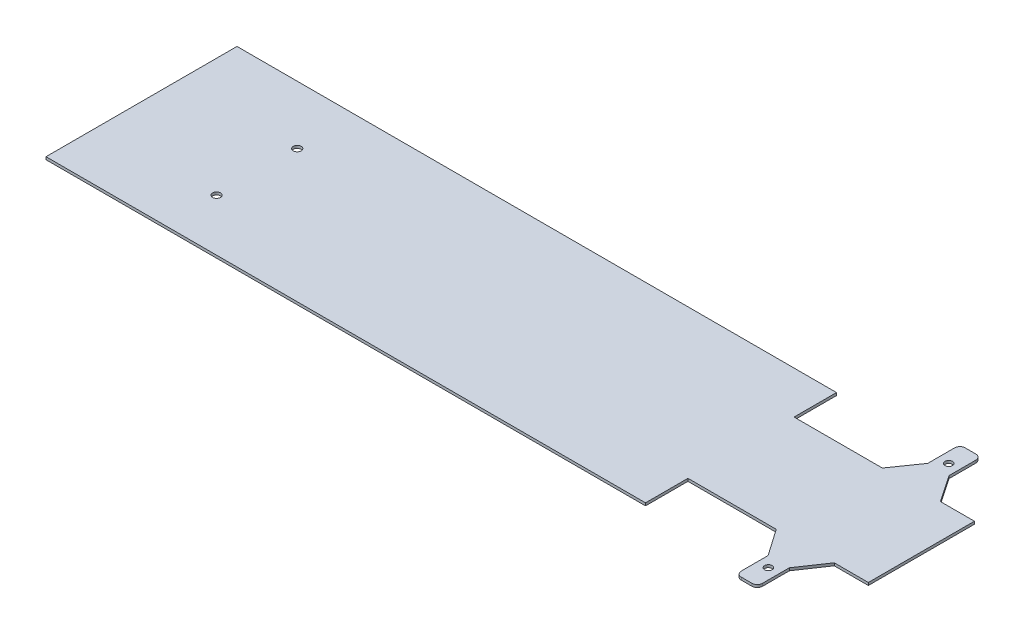
ISO-10303-21;
HEADER;
FILE_DESCRIPTION(('STEP AP214'),'2;1');
FILE_NAME('part.step','',(''),(''),'','','');
FILE_SCHEMA(('AUTOMOTIVE_DESIGN { 1 0 10303 214 1 1 1 1 }'));
ENDSEC;
DATA;
#1=APPLICATION_CONTEXT('core data for automotive mechanical design processes');
#2=APPLICATION_PROTOCOL_DEFINITION('international standard','automotive_design',2000,#1);
#3=PRODUCT_CONTEXT('',#1,'mechanical');
#4=PRODUCT('Part','Part','',(#3));
#5=PRODUCT_RELATED_PRODUCT_CATEGORY('part','',(#4));
#6=PRODUCT_DEFINITION_FORMATION('','',#4);
#7=PRODUCT_DEFINITION_CONTEXT('part definition',#1,'design');
#8=PRODUCT_DEFINITION('design','',#6,#7);
#9=PRODUCT_DEFINITION_SHAPE('','',#8);
#10=(LENGTH_UNIT() NAMED_UNIT(*) SI_UNIT(.MILLI.,.METRE.));
#11=(NAMED_UNIT(*) PLANE_ANGLE_UNIT() SI_UNIT($,.RADIAN.));
#12=(NAMED_UNIT(*) SI_UNIT($,.STERADIAN.) SOLID_ANGLE_UNIT());
#13=UNCERTAINTY_MEASURE_WITH_UNIT(LENGTH_MEASURE(1.E-05),#10,'distance_accuracy_value','');
#14=(GEOMETRIC_REPRESENTATION_CONTEXT(3) GLOBAL_UNCERTAINTY_ASSIGNED_CONTEXT((#13)) GLOBAL_UNIT_ASSIGNED_CONTEXT((#10,
#11,#12)) REPRESENTATION_CONTEXT('',''));
#15=CARTESIAN_POINT('',(0.,0.,0.));
#16=DIRECTION('',(0.,0.,1.));
#17=DIRECTION('',(1.,0.,0.));
#18=AXIS2_PLACEMENT_3D('',#15,#16,#17);
#19=CARTESIAN_POINT('',(-479.708642175763,5.,-523.631578947368));
#20=DIRECTION('',(0.,-1.,0.));
#21=DIRECTION('',(0.,0.,-1.));
#22=AXIS2_PLACEMENT_3D('',#19,#20,#21);
#23=PLANE('',#22);
#24=CARTESIAN_POINT('',(-1597.77020639475,5.,-392.549644623472));
#25=DIRECTION('',(0.,1.,0.));
#26=DIRECTION('',(0.,0.,1.));
#27=AXIS2_PLACEMENT_3D('',#24,#25,#26);
#28=CIRCLE('',#27,7.49999999999996);
#29=CARTESIAN_POINT('',(-1597.77020639475,5.,-385.049644623472));
#30=VERTEX_POINT('',#29);
#31=EDGE_CURVE('E395',#30,#30,#28,.T.);
#32=ORIENTED_EDGE('',*,*,#31,.F.);
#33=EDGE_LOOP('',(#32));
#34=FACE_BOUND('',#33,.T.);
#35=CARTESIAN_POINT('',(-1597.77020639475,5.,-240.607702450479));
#36=DIRECTION('',(0.,1.,0.));
#37=DIRECTION('',(0.,0.,1.));
#38=AXIS2_PLACEMENT_3D('',#35,#36,#37);
#39=CIRCLE('',#38,7.49999999999996);
#40=CARTESIAN_POINT('',(-1597.77020639475,5.,-233.107702450479));
#41=VERTEX_POINT('',#40);
#42=EDGE_CURVE('E403',#41,#41,#39,.T.);
#43=ORIENTED_EDGE('',*,*,#42,.F.);
#44=EDGE_LOOP('',(#43));
#45=FACE_BOUND('',#44,.T.);
#46=DIRECTION('',(0.,0.,-1.));
#47=VECTOR('',#46,1.);
#48=CARTESIAN_POINT('',(-691.29647542446,5.,-502.631578947368));
#49=LINE('',#48,#47);
#50=CARTESIAN_POINT('',(-691.29647542446,5.,-422.631578947368));
#51=VERTEX_POINT('',#50);
#52=CARTESIAN_POINT('',(-691.29647542446,5.,-502.631578947368));
#53=VERTEX_POINT('',#52);
#54=EDGE_CURVE('E311',#51,#53,#49,.T.);
#55=ORIENTED_EDGE('',*,*,#54,.T.);
#56=DIRECTION('',(-1.,0.,0.));
#57=VECTOR('',#56,1.);
#58=CARTESIAN_POINT('',(-691.29647542446,5.,-502.631578947368));
#59=LINE('',#58,#57);
#60=CARTESIAN_POINT('',(-1821.29647542446,5.,-502.631578947368));
#61=VERTEX_POINT('',#60);
#62=EDGE_CURVE('E151',#53,#61,#59,.T.);
#63=ORIENTED_EDGE('',*,*,#62,.T.);
#64=DIRECTION('',(0.,0.,1.));
#65=VECTOR('',#64,1.);
#66=CARTESIAN_POINT('',(-1821.29647542446,5.,-502.631578947368));
#67=LINE('',#66,#65);
#68=CARTESIAN_POINT('',(-1821.29647542446,5.,-142.631578947368));
#69=VERTEX_POINT('',#68);
#70=EDGE_CURVE('E429',#61,#69,#67,.T.);
#71=ORIENTED_EDGE('',*,*,#70,.T.);
#72=DIRECTION('',(1.,0.,0.));
#73=VECTOR('',#72,1.);
#74=CARTESIAN_POINT('',(-691.29647542446,5.,-142.631578947368));
#75=LINE('',#74,#73);
#76=CARTESIAN_POINT('',(-691.29647542446,5.,-142.631578947368));
#77=VERTEX_POINT('',#76);
#78=EDGE_CURVE('E432',#69,#77,#75,.T.);
#79=ORIENTED_EDGE('',*,*,#78,.T.);
#80=DIRECTION('',(0.,0.,-1.));
#81=VECTOR('',#80,1.);
#82=CARTESIAN_POINT('',(-691.29647542446,5.,-222.631578947368));
#83=LINE('',#82,#81);
#84=CARTESIAN_POINT('',(-691.29647542446,5.,-222.631578947368));
#85=VERTEX_POINT('',#84);
#86=EDGE_CURVE('E435',#77,#85,#83,.T.);
#87=ORIENTED_EDGE('',*,*,#86,.T.);
#88=DIRECTION('',(1.,0.,0.));
#89=VECTOR('',#88,1.);
#90=CARTESIAN_POINT('',(-691.29647542446,5.,-222.631578947368));
#91=LINE('',#90,#89);
#92=CARTESIAN_POINT('',(-524.868977384382,5.,-222.631578947368));
#93=VERTEX_POINT('',#92);
#94=EDGE_CURVE('E438',#85,#93,#91,.T.);
#95=ORIENTED_EDGE('',*,*,#94,.T.);
#96=DIRECTION('',(0.571391892362466,0.,0.820677345454619));
#97=VECTOR('',#96,1.);
#98=CARTESIAN_POINT('',(-489.708642175763,5.,-172.131578947368));
#99=LINE('',#98,#97);
#100=CARTESIAN_POINT('',(-489.708642175763,5.,-172.131578947368));
#101=VERTEX_POINT('',#100);
#102=EDGE_CURVE('E441',#93,#101,#99,.T.);
#103=ORIENTED_EDGE('',*,*,#102,.T.);
#104=DIRECTION('',(0.,0.,1.));
#105=VECTOR('',#104,1.);
#106=CARTESIAN_POINT('',(-489.708642175763,5.,-172.131578947368));
#107=LINE('',#106,#105);
#108=CARTESIAN_POINT('',(-489.708642175763,5.,-121.631578947368));
#109=VERTEX_POINT('',#108);
#110=EDGE_CURVE('E444',#101,#109,#107,.T.);
#111=ORIENTED_EDGE('',*,*,#110,.T.);
#112=CARTESIAN_POINT('',(-479.708642175763,5.,-121.631578947368));
#113=DIRECTION('',(0.,1.,0.));
#114=DIRECTION('',(0.,0.,1.));
#115=AXIS2_PLACEMENT_3D('',#112,#113,#114);
#116=CIRCLE('',#115,10.);
#117=CARTESIAN_POINT('',(-479.708642175763,5.,-111.631578947368));
#118=VERTEX_POINT('',#117);
#119=EDGE_CURVE('E447',#109,#118,#116,.T.);
#120=ORIENTED_EDGE('',*,*,#119,.T.);
#121=DIRECTION('',(1.,0.,0.));
#122=VECTOR('',#121,1.);
#123=CARTESIAN_POINT('',(-479.708642175763,5.,-111.631578947368));
#124=LINE('',#123,#122);
#125=CARTESIAN_POINT('',(-459.708642175763,5.,-111.631578947369));
#126=VERTEX_POINT('',#125);
#127=EDGE_CURVE('E450',#118,#126,#124,.T.);
#128=ORIENTED_EDGE('',*,*,#127,.T.);
#129=CARTESIAN_POINT('',(-459.708642175763,5.,-121.631578947369));
#130=DIRECTION('',(0.,1.,0.));
#131=DIRECTION('',(0.,0.,1.));
#132=AXIS2_PLACEMENT_3D('',#129,#130,#131);
#133=CIRCLE('',#132,10.);
#134=CARTESIAN_POINT('',(-449.708642175763,5.,-121.631578947369));
#135=VERTEX_POINT('',#134);
#136=EDGE_CURVE('E453',#126,#135,#133,.T.);
#137=ORIENTED_EDGE('',*,*,#136,.T.);
#138=DIRECTION('',(0.,0.,-1.));
#139=VECTOR('',#138,1.);
#140=CARTESIAN_POINT('',(-449.708642175763,5.,-172.131578947369));
#141=LINE('',#140,#139);
#142=CARTESIAN_POINT('',(-449.708642175763,5.,-172.131578947369));
#143=VERTEX_POINT('',#142);
#144=EDGE_CURVE('E456',#135,#143,#141,.T.);
#145=ORIENTED_EDGE('',*,*,#144,.T.);
#146=DIRECTION('',(0.560360137310002,0.,-0.828249066714787));
#147=VECTOR('',#146,1.);
#148=CARTESIAN_POINT('',(-449.708642175763,5.,-172.131578947369));
#149=LINE('',#148,#147);
#150=CARTESIAN_POINT('',(-415.542365301587,5.,-222.631578947368));
#151=VERTEX_POINT('',#150);
#152=EDGE_CURVE('E459',#143,#151,#149,.T.);
#153=ORIENTED_EDGE('',*,*,#152,.T.);
#154=DIRECTION('',(1.,0.,0.));
#155=VECTOR('',#154,1.);
#156=CARTESIAN_POINT('',(-415.542365301587,5.,-222.631578947368));
#157=LINE('',#156,#155);
#158=CARTESIAN_POINT('',(-351.29647542446,5.,-222.631578947368));
#159=VERTEX_POINT('',#158);
#160=EDGE_CURVE('E462',#151,#159,#157,.T.);
#161=ORIENTED_EDGE('',*,*,#160,.T.);
#162=DIRECTION('',(0.,0.,-1.));
#163=VECTOR('',#162,1.);
#164=CARTESIAN_POINT('',(-351.29647542446,5.,-422.631578947368));
#165=LINE('',#164,#163);
#166=CARTESIAN_POINT('',(-351.29647542446,5.,-422.631578947368));
#167=VERTEX_POINT('',#166);
#168=EDGE_CURVE('E465',#159,#167,#165,.T.);
#169=ORIENTED_EDGE('',*,*,#168,.T.);
#170=DIRECTION('',(-1.,0.,0.));
#171=VECTOR('',#170,1.);
#172=CARTESIAN_POINT('',(-415.542365301587,5.,-422.631578947368));
#173=LINE('',#172,#171);
#174=CARTESIAN_POINT('',(-415.542365301587,5.,-422.631578947368));
#175=VERTEX_POINT('',#174);
#176=EDGE_CURVE('E468',#167,#175,#173,.T.);
#177=ORIENTED_EDGE('',*,*,#176,.T.);
#178=DIRECTION('',(-0.560360137310002,0.,-0.828249066714787));
#179=VECTOR('',#178,1.);
#180=CARTESIAN_POINT('',(-449.708642175763,5.,-473.131578947368));
#181=LINE('',#180,#179);
#182=CARTESIAN_POINT('',(-449.708642175763,5.,-473.131578947368));
#183=VERTEX_POINT('',#182);
#184=EDGE_CURVE('E471',#175,#183,#181,.T.);
#185=ORIENTED_EDGE('',*,*,#184,.T.);
#186=DIRECTION('',(0.,0.,-1.));
#187=VECTOR('',#186,1.);
#188=CARTESIAN_POINT('',(-449.708642175763,5.,-473.131578947368));
#189=LINE('',#188,#187);
#190=CARTESIAN_POINT('',(-449.708642175763,5.,-523.631578947368));
#191=VERTEX_POINT('',#190);
#192=EDGE_CURVE('E474',#183,#191,#189,.T.);
#193=ORIENTED_EDGE('',*,*,#192,.T.);
#194=CARTESIAN_POINT('',(-459.708642175763,5.,-523.631578947368));
#195=DIRECTION('',(0.,1.,0.));
#196=DIRECTION('',(0.,0.,-1.));
#197=AXIS2_PLACEMENT_3D('',#194,#195,#196);
#198=CIRCLE('',#197,10.);
#199=CARTESIAN_POINT('',(-459.708642175763,5.,-533.631578947368));
#200=VERTEX_POINT('',#199);
#201=EDGE_CURVE('E477',#191,#200,#198,.T.);
#202=ORIENTED_EDGE('',*,*,#201,.T.);
#203=DIRECTION('',(-1.,0.,0.));
#204=VECTOR('',#203,1.);
#205=CARTESIAN_POINT('',(-479.708642175763,5.,-533.631578947368));
#206=LINE('',#205,#204);
#207=CARTESIAN_POINT('',(-479.708642175763,5.,-533.631578947368));
#208=VERTEX_POINT('',#207);
#209=EDGE_CURVE('E480',#200,#208,#206,.T.);
#210=ORIENTED_EDGE('',*,*,#209,.T.);
#211=CARTESIAN_POINT('',(-479.708642175763,5.,-523.631578947368));
#212=DIRECTION('',(0.,1.,0.));
#213=DIRECTION('',(0.,0.,-1.));
#214=AXIS2_PLACEMENT_3D('',#211,#212,#213);
#215=CIRCLE('',#214,10.);
#216=CARTESIAN_POINT('',(-489.708642175763,5.,-523.631578947368));
#217=VERTEX_POINT('',#216);
#218=EDGE_CURVE('E218',#208,#217,#215,.T.);
#219=ORIENTED_EDGE('',*,*,#218,.T.);
#220=DIRECTION('',(0.,0.,1.));
#221=VECTOR('',#220,1.);
#222=CARTESIAN_POINT('',(-489.708642175763,5.,-473.131578947368));
#223=LINE('',#222,#221);
#224=CARTESIAN_POINT('',(-489.708642175763,5.,-473.131578947368));
#225=VERTEX_POINT('',#224);
#226=EDGE_CURVE('E212',#217,#225,#223,.T.);
#227=ORIENTED_EDGE('',*,*,#226,.T.);
#228=DIRECTION('',(-0.571391892362466,0.,0.820677345454619));
#229=VECTOR('',#228,1.);
#230=CARTESIAN_POINT('',(-489.708642175763,5.,-473.131578947368));
#231=LINE('',#230,#229);
#232=CARTESIAN_POINT('',(-524.868977384382,5.,-422.631578947368));
#233=VERTEX_POINT('',#232);
#234=EDGE_CURVE('E216',#225,#233,#231,.T.);
#235=ORIENTED_EDGE('',*,*,#234,.T.);
#236=DIRECTION('',(-1.,0.,0.));
#237=VECTOR('',#236,1.);
#238=CARTESIAN_POINT('',(-691.29647542446,5.,-422.631578947368));
#239=LINE('',#238,#237);
#240=EDGE_CURVE('E60',#233,#51,#239,.T.);
#241=ORIENTED_EDGE('',*,*,#240,.T.);
#242=EDGE_LOOP('',(#55,#63,#71,#79,#87,#95,#103,#111,#120,#128,#137,#145,#153,#161,#169,#177,
#185,#193,#202,#210,#219,#227,#235,#241));
#243=FACE_BOUND('',#242,.T.);
#244=CARTESIAN_POINT('',(-469.708642175763,5.,-492.631578947368));
#245=DIRECTION('',(0.,1.,0.));
#246=DIRECTION('',(0.,0.,1.));
#247=AXIS2_PLACEMENT_3D('',#244,#245,#246);
#248=CIRCLE('',#247,6.99999999999999);
#249=CARTESIAN_POINT('',(-469.708642175763,5.,-485.631578947368));
#250=VERTEX_POINT('',#249);
#251=EDGE_CURVE('E245',#250,#250,#248,.T.);
#252=ORIENTED_EDGE('',*,*,#251,.F.);
#253=EDGE_LOOP('',(#252));
#254=FACE_BOUND('',#253,.T.);
#255=CARTESIAN_POINT('',(-469.708642175763,5.,-152.631578947368));
#256=DIRECTION('',(0.,1.,0.));
#257=DIRECTION('',(0.,0.,1.));
#258=AXIS2_PLACEMENT_3D('',#255,#256,#257);
#259=CIRCLE('',#258,6.99999999999999);
#260=CARTESIAN_POINT('',(-469.708642175763,5.,-145.631578947368));
#261=VERTEX_POINT('',#260);
#262=EDGE_CURVE('E411',#261,#261,#259,.T.);
#263=ORIENTED_EDGE('',*,*,#262,.F.);
#264=EDGE_LOOP('',(#263));
#265=FACE_BOUND('',#264,.T.);
#266=ADVANCED_FACE('F40',(#34,#45,#243,#254,#265),#23,.F.);
#267=CARTESIAN_POINT('',(-479.708642175763,0.,-523.631578947368));
#268=DIRECTION('',(0.,-1.,0.));
#269=DIRECTION('',(0.,0.,-1.));
#270=AXIS2_PLACEMENT_3D('',#267,#268,#269);
#271=PLANE('',#270);
#272=CARTESIAN_POINT('',(-1597.77020639475,0.,-392.549644623472));
#273=DIRECTION('',(0.,-1.,0.));
#274=DIRECTION('',(0.,0.,-1.));
#275=AXIS2_PLACEMENT_3D('',#272,#273,#274);
#276=CIRCLE('',#275,7.49999999999996);
#277=CARTESIAN_POINT('',(-1597.77020639475,0.,-400.049644623472));
#278=VERTEX_POINT('',#277);
#279=EDGE_CURVE('E44',#278,#278,#276,.T.);
#280=ORIENTED_EDGE('',*,*,#279,.F.);
#281=EDGE_LOOP('',(#280));
#282=FACE_BOUND('',#281,.T.);
#283=CARTESIAN_POINT('',(-1597.77020639475,0.,-240.607702450479));
#284=DIRECTION('',(0.,-1.,0.));
#285=DIRECTION('',(0.,0.,-1.));
#286=AXIS2_PLACEMENT_3D('',#283,#284,#285);
#287=CIRCLE('',#286,7.49999999999996);
#288=CARTESIAN_POINT('',(-1597.77020639475,0.,-248.107702450479));
#289=VERTEX_POINT('',#288);
#290=EDGE_CURVE('E392',#289,#289,#287,.T.);
#291=ORIENTED_EDGE('',*,*,#290,.F.);
#292=EDGE_LOOP('',(#291));
#293=FACE_BOUND('',#292,.T.);
#294=CARTESIAN_POINT('',(-469.708642175763,0.,-492.631578947368));
#295=DIRECTION('',(0.,1.,0.));
#296=DIRECTION('',(0.,0.,1.));
#297=AXIS2_PLACEMENT_3D('',#294,#295,#296);
#298=CIRCLE('',#297,6.99999999999999);
#299=CARTESIAN_POINT('',(-469.708642175763,0.,-485.631578947368));
#300=VERTEX_POINT('',#299);
#301=EDGE_CURVE('E415',#300,#300,#298,.T.);
#302=ORIENTED_EDGE('',*,*,#301,.T.);
#303=EDGE_LOOP('',(#302));
#304=FACE_BOUND('',#303,.T.);
#305=DIRECTION('',(0.,0.,-1.));
#306=VECTOR('',#305,1.);
#307=CARTESIAN_POINT('',(-691.29647542446,0.,-502.631578947368));
#308=LINE('',#307,#306);
#309=CARTESIAN_POINT('',(-691.29647542446,0.,-422.631578947368));
#310=VERTEX_POINT('',#309);
#311=CARTESIAN_POINT('',(-691.29647542446,0.,-502.631578947368));
#312=VERTEX_POINT('',#311);
#313=EDGE_CURVE('E240',#310,#312,#308,.T.);
#314=ORIENTED_EDGE('',*,*,#313,.F.);
#315=DIRECTION('',(-1.,0.,0.));
#316=VECTOR('',#315,1.);
#317=CARTESIAN_POINT('',(-691.29647542446,0.,-422.631578947368));
#318=LINE('',#317,#316);
#319=CARTESIAN_POINT('',(-524.868977384382,0.,-422.631578947368));
#320=VERTEX_POINT('',#319);
#321=EDGE_CURVE('E143',#320,#310,#318,.T.);
#322=ORIENTED_EDGE('',*,*,#321,.F.);
#323=DIRECTION('',(-0.571391892362466,0.,0.820677345454619));
#324=VECTOR('',#323,1.);
#325=CARTESIAN_POINT('',(-489.708642175763,0.,-473.131578947368));
#326=LINE('',#325,#324);
#327=CARTESIAN_POINT('',(-489.708642175763,0.,-473.131578947368));
#328=VERTEX_POINT('',#327);
#329=EDGE_CURVE('E137',#328,#320,#326,.T.);
#330=ORIENTED_EDGE('',*,*,#329,.F.);
#331=DIRECTION('',(0.,0.,1.));
#332=VECTOR('',#331,1.);
#333=CARTESIAN_POINT('',(-489.708642175763,0.,-473.131578947368));
#334=LINE('',#333,#332);
#335=CARTESIAN_POINT('',(-489.708642175763,0.,-523.631578947368));
#336=VERTEX_POINT('',#335);
#337=EDGE_CURVE('E227',#336,#328,#334,.T.);
#338=ORIENTED_EDGE('',*,*,#337,.F.);
#339=CARTESIAN_POINT('',(-479.708642175763,0.,-523.631578947368));
#340=DIRECTION('',(0.,1.,0.));
#341=DIRECTION('',(0.,0.,-1.));
#342=AXIS2_PLACEMENT_3D('',#339,#340,#341);
#343=CIRCLE('',#342,10.);
#344=CARTESIAN_POINT('',(-479.708642175763,0.,-533.631578947368));
#345=VERTEX_POINT('',#344);
#346=EDGE_CURVE('E302',#345,#336,#343,.T.);
#347=ORIENTED_EDGE('',*,*,#346,.F.);
#348=DIRECTION('',(-1.,0.,0.));
#349=VECTOR('',#348,1.);
#350=CARTESIAN_POINT('',(-479.708642175763,0.,-533.631578947368));
#351=LINE('',#350,#349);
#352=CARTESIAN_POINT('',(-459.708642175763,0.,-533.631578947368));
#353=VERTEX_POINT('',#352);
#354=EDGE_CURVE('E299',#353,#345,#351,.T.);
#355=ORIENTED_EDGE('',*,*,#354,.F.);
#356=CARTESIAN_POINT('',(-459.708642175763,0.,-523.631578947368));
#357=DIRECTION('',(0.,1.,0.));
#358=DIRECTION('',(0.,0.,-1.));
#359=AXIS2_PLACEMENT_3D('',#356,#357,#358);
#360=CIRCLE('',#359,10.);
#361=CARTESIAN_POINT('',(-449.708642175763,0.,-523.631578947368));
#362=VERTEX_POINT('',#361);
#363=EDGE_CURVE('E296',#362,#353,#360,.T.);
#364=ORIENTED_EDGE('',*,*,#363,.F.);
#365=DIRECTION('',(0.,0.,-1.));
#366=VECTOR('',#365,1.);
#367=CARTESIAN_POINT('',(-449.708642175763,0.,-473.131578947368));
#368=LINE('',#367,#366);
#369=CARTESIAN_POINT('',(-449.708642175763,0.,-473.131578947368));
#370=VERTEX_POINT('',#369);
#371=EDGE_CURVE('E293',#370,#362,#368,.T.);
#372=ORIENTED_EDGE('',*,*,#371,.F.);
#373=DIRECTION('',(-0.560360137310002,0.,-0.828249066714787));
#374=VECTOR('',#373,1.);
#375=CARTESIAN_POINT('',(-449.708642175763,0.,-473.131578947368));
#376=LINE('',#375,#374);
#377=CARTESIAN_POINT('',(-415.542365301587,0.,-422.631578947368));
#378=VERTEX_POINT('',#377);
#379=EDGE_CURVE('E290',#378,#370,#376,.T.);
#380=ORIENTED_EDGE('',*,*,#379,.F.);
#381=DIRECTION('',(-1.,0.,0.));
#382=VECTOR('',#381,1.);
#383=CARTESIAN_POINT('',(-415.542365301587,0.,-422.631578947368));
#384=LINE('',#383,#382);
#385=CARTESIAN_POINT('',(-351.29647542446,0.,-422.631578947368));
#386=VERTEX_POINT('',#385);
#387=EDGE_CURVE('E287',#386,#378,#384,.T.);
#388=ORIENTED_EDGE('',*,*,#387,.F.);
#389=DIRECTION('',(0.,0.,-1.));
#390=VECTOR('',#389,1.);
#391=CARTESIAN_POINT('',(-351.29647542446,0.,-422.631578947368));
#392=LINE('',#391,#390);
#393=CARTESIAN_POINT('',(-351.29647542446,0.,-222.631578947368));
#394=VERTEX_POINT('',#393);
#395=EDGE_CURVE('E284',#394,#386,#392,.T.);
#396=ORIENTED_EDGE('',*,*,#395,.F.);
#397=DIRECTION('',(1.,0.,0.));
#398=VECTOR('',#397,1.);
#399=CARTESIAN_POINT('',(-415.542365301587,0.,-222.631578947368));
#400=LINE('',#399,#398);
#401=CARTESIAN_POINT('',(-415.542365301587,0.,-222.631578947368));
#402=VERTEX_POINT('',#401);
#403=EDGE_CURVE('E281',#402,#394,#400,.T.);
#404=ORIENTED_EDGE('',*,*,#403,.F.);
#405=DIRECTION('',(0.560360137310002,0.,-0.828249066714787));
#406=VECTOR('',#405,1.);
#407=CARTESIAN_POINT('',(-449.708642175763,0.,-172.131578947369));
#408=LINE('',#407,#406);
#409=CARTESIAN_POINT('',(-449.708642175763,0.,-172.131578947369));
#410=VERTEX_POINT('',#409);
#411=EDGE_CURVE('E278',#410,#402,#408,.T.);
#412=ORIENTED_EDGE('',*,*,#411,.F.);
#413=DIRECTION('',(0.,0.,-1.));
#414=VECTOR('',#413,1.);
#415=CARTESIAN_POINT('',(-449.708642175763,0.,-172.131578947369));
#416=LINE('',#415,#414);
#417=CARTESIAN_POINT('',(-449.708642175763,0.,-121.631578947369));
#418=VERTEX_POINT('',#417);
#419=EDGE_CURVE('E275',#418,#410,#416,.T.);
#420=ORIENTED_EDGE('',*,*,#419,.F.);
#421=CARTESIAN_POINT('',(-459.708642175763,0.,-121.631578947369));
#422=DIRECTION('',(0.,1.,0.));
#423=DIRECTION('',(0.,0.,1.));
#424=AXIS2_PLACEMENT_3D('',#421,#422,#423);
#425=CIRCLE('',#424,10.);
#426=CARTESIAN_POINT('',(-459.708642175763,0.,-111.631578947369));
#427=VERTEX_POINT('',#426);
#428=EDGE_CURVE('E272',#427,#418,#425,.T.);
#429=ORIENTED_EDGE('',*,*,#428,.F.);
#430=DIRECTION('',(1.,0.,0.));
#431=VECTOR('',#430,1.);
#432=CARTESIAN_POINT('',(-479.708642175763,0.,-111.631578947368));
#433=LINE('',#432,#431);
#434=CARTESIAN_POINT('',(-479.708642175763,0.,-111.631578947368));
#435=VERTEX_POINT('',#434);
#436=EDGE_CURVE('E269',#435,#427,#433,.T.);
#437=ORIENTED_EDGE('',*,*,#436,.F.);
#438=CARTESIAN_POINT('',(-479.708642175763,0.,-121.631578947368));
#439=DIRECTION('',(0.,1.,0.));
#440=DIRECTION('',(0.,0.,1.));
#441=AXIS2_PLACEMENT_3D('',#438,#439,#440);
#442=CIRCLE('',#441,10.);
#443=CARTESIAN_POINT('',(-489.708642175763,0.,-121.631578947368));
#444=VERTEX_POINT('',#443);
#445=EDGE_CURVE('E266',#444,#435,#442,.T.);
#446=ORIENTED_EDGE('',*,*,#445,.F.);
#447=DIRECTION('',(0.,0.,1.));
#448=VECTOR('',#447,1.);
#449=CARTESIAN_POINT('',(-489.708642175763,0.,-172.131578947368));
#450=LINE('',#449,#448);
#451=CARTESIAN_POINT('',(-489.708642175763,0.,-172.131578947368));
#452=VERTEX_POINT('',#451);
#453=EDGE_CURVE('E263',#452,#444,#450,.T.);
#454=ORIENTED_EDGE('',*,*,#453,.F.);
#455=DIRECTION('',(0.571391892362466,0.,0.820677345454619));
#456=VECTOR('',#455,1.);
#457=CARTESIAN_POINT('',(-489.708642175763,0.,-172.131578947368));
#458=LINE('',#457,#456);
#459=CARTESIAN_POINT('',(-524.868977384382,0.,-222.631578947368));
#460=VERTEX_POINT('',#459);
#461=EDGE_CURVE('E260',#460,#452,#458,.T.);
#462=ORIENTED_EDGE('',*,*,#461,.F.);
#463=DIRECTION('',(1.,0.,0.));
#464=VECTOR('',#463,1.);
#465=CARTESIAN_POINT('',(-691.29647542446,0.,-222.631578947368));
#466=LINE('',#465,#464);
#467=CARTESIAN_POINT('',(-691.29647542446,0.,-222.631578947368));
#468=VERTEX_POINT('',#467);
#469=EDGE_CURVE('E257',#468,#460,#466,.T.);
#470=ORIENTED_EDGE('',*,*,#469,.F.);
#471=DIRECTION('',(0.,0.,-1.));
#472=VECTOR('',#471,1.);
#473=CARTESIAN_POINT('',(-691.29647542446,0.,-222.631578947368));
#474=LINE('',#473,#472);
#475=CARTESIAN_POINT('',(-691.29647542446,0.,-142.631578947368));
#476=VERTEX_POINT('',#475);
#477=EDGE_CURVE('E254',#476,#468,#474,.T.);
#478=ORIENTED_EDGE('',*,*,#477,.F.);
#479=DIRECTION('',(1.,0.,0.));
#480=VECTOR('',#479,1.);
#481=CARTESIAN_POINT('',(-691.29647542446,0.,-142.631578947368));
#482=LINE('',#481,#480);
#483=CARTESIAN_POINT('',(-1821.29647542446,0.,-142.631578947368));
#484=VERTEX_POINT('',#483);
#485=EDGE_CURVE('E251',#484,#476,#482,.T.);
#486=ORIENTED_EDGE('',*,*,#485,.F.);
#487=DIRECTION('',(0.,0.,1.));
#488=VECTOR('',#487,1.);
#489=CARTESIAN_POINT('',(-1821.29647542446,0.,-502.631578947368));
#490=LINE('',#489,#488);
#491=CARTESIAN_POINT('',(-1821.29647542446,0.,-502.631578947368));
#492=VERTEX_POINT('',#491);
#493=EDGE_CURVE('E248',#492,#484,#490,.T.);
#494=ORIENTED_EDGE('',*,*,#493,.F.);
#495=DIRECTION('',(-1.,0.,0.));
#496=VECTOR('',#495,1.);
#497=CARTESIAN_POINT('',(-691.29647542446,0.,-502.631578947368));
#498=LINE('',#497,#496);
#499=EDGE_CURVE('E244',#312,#492,#498,.T.);
#500=ORIENTED_EDGE('',*,*,#499,.F.);
#501=EDGE_LOOP('',(#314,#322,#330,#338,#347,#355,#364,#372,#380,#388,#396,#404,#412,#420,#429,
#437,#446,#454,#462,#470,#478,#486,#494,#500));
#502=FACE_BOUND('',#501,.T.);
#503=CARTESIAN_POINT('',(-469.708642175763,0.,-152.631578947368));
#504=DIRECTION('',(0.,1.,0.));
#505=DIRECTION('',(0.,0.,1.));
#506=AXIS2_PLACEMENT_3D('',#503,#504,#505);
#507=CIRCLE('',#506,6.99999999999999);
#508=CARTESIAN_POINT('',(-469.708642175763,0.,-145.631578947368));
#509=VERTEX_POINT('',#508);
#510=EDGE_CURVE('E401',#509,#509,#507,.T.);
#511=ORIENTED_EDGE('',*,*,#510,.T.);
#512=EDGE_LOOP('',(#511));
#513=FACE_BOUND('',#512,.T.);
#514=ADVANCED_FACE('F495',(#282,#293,#304,#502,#513),#271,.T.);
#515=CARTESIAN_POINT('',(-691.29647542446,5.,-502.631578947368));
#516=DIRECTION('',(-1.,0.,0.));
#517=DIRECTION('',(0.,0.,1.));
#518=AXIS2_PLACEMENT_3D('',#515,#516,#517);
#519=PLANE('',#518);
#520=ORIENTED_EDGE('',*,*,#313,.T.);
#521=DIRECTION('',(0.,-1.,0.));
#522=VECTOR('',#521,1.);
#523=CARTESIAN_POINT('',(-691.29647542446,5.,-502.631578947368));
#524=LINE('',#523,#522);
#525=EDGE_CURVE('E11',#53,#312,#524,.T.);
#526=ORIENTED_EDGE('',*,*,#525,.F.);
#527=ORIENTED_EDGE('',*,*,#54,.F.);
#528=DIRECTION('',(0.,-1.,0.));
#529=VECTOR('',#528,1.);
#530=CARTESIAN_POINT('',(-691.29647542446,5.,-422.631578947368));
#531=LINE('',#530,#529);
#532=EDGE_CURVE('E236',#51,#310,#531,.T.);
#533=ORIENTED_EDGE('',*,*,#532,.T.);
#534=EDGE_LOOP('',(#520,#526,#527,#533));
#535=FACE_BOUND('',#534,.T.);
#536=ADVANCED_FACE('F42',(#535),#519,.F.);
#537=CARTESIAN_POINT('',(-691.29647542446,5.,-502.631578947368));
#538=DIRECTION('',(0.,0.,1.));
#539=DIRECTION('',(1.,0.,0.));
#540=AXIS2_PLACEMENT_3D('',#537,#538,#539);
#541=PLANE('',#540);
#542=ORIENTED_EDGE('',*,*,#499,.T.);
#543=DIRECTION('',(0.,-1.,0.));
#544=VECTOR('',#543,1.);
#545=CARTESIAN_POINT('',(-1821.29647542446,5.,-502.631578947368));
#546=LINE('',#545,#544);
#547=EDGE_CURVE('E51',#61,#492,#546,.T.);
#548=ORIENTED_EDGE('',*,*,#547,.F.);
#549=ORIENTED_EDGE('',*,*,#62,.F.);
#550=ORIENTED_EDGE('',*,*,#525,.T.);
#551=EDGE_LOOP('',(#542,#548,#549,#550));
#552=FACE_BOUND('',#551,.T.);
#553=ADVANCED_FACE('F755',(#552),#541,.F.);
#554=CARTESIAN_POINT('',(-1821.29647542446,5.,-502.631578947368));
#555=DIRECTION('',(1.,0.,0.));
#556=DIRECTION('',(0.,0.,-1.));
#557=AXIS2_PLACEMENT_3D('',#554,#555,#556);
#558=PLANE('',#557);
#559=ORIENTED_EDGE('',*,*,#493,.T.);
#560=DIRECTION('',(0.,-1.,0.));
#561=VECTOR('',#560,1.);
#562=CARTESIAN_POINT('',(-1821.29647542446,5.,-142.631578947368));
#563=LINE('',#562,#561);
#564=EDGE_CURVE('E386',#69,#484,#563,.T.);
#565=ORIENTED_EDGE('',*,*,#564,.F.);
#566=ORIENTED_EDGE('',*,*,#70,.F.);
#567=ORIENTED_EDGE('',*,*,#547,.T.);
#568=EDGE_LOOP('',(#559,#565,#566,#567));
#569=FACE_BOUND('',#568,.T.);
#570=ADVANCED_FACE('F745',(#569),#558,.F.);
#571=CARTESIAN_POINT('',(-691.29647542446,5.,-142.631578947368));
#572=DIRECTION('',(0.,0.,-1.));
#573=DIRECTION('',(-1.,0.,0.));
#574=AXIS2_PLACEMENT_3D('',#571,#572,#573);
#575=PLANE('',#574);
#576=ORIENTED_EDGE('',*,*,#485,.T.);
#577=DIRECTION('',(0.,-1.,0.));
#578=VECTOR('',#577,1.);
#579=CARTESIAN_POINT('',(-691.29647542446,5.,-142.631578947368));
#580=LINE('',#579,#578);
#581=EDGE_CURVE('E382',#77,#476,#580,.T.);
#582=ORIENTED_EDGE('',*,*,#581,.F.);
#583=ORIENTED_EDGE('',*,*,#78,.F.);
#584=ORIENTED_EDGE('',*,*,#564,.T.);
#585=EDGE_LOOP('',(#576,#582,#583,#584));
#586=FACE_BOUND('',#585,.T.);
#587=ADVANCED_FACE('F735',(#586),#575,.F.);
#588=CARTESIAN_POINT('',(-691.29647542446,5.,-222.631578947368));
#589=DIRECTION('',(-1.,0.,0.));
#590=DIRECTION('',(0.,0.,1.));
#591=AXIS2_PLACEMENT_3D('',#588,#589,#590);
#592=PLANE('',#591);
#593=ORIENTED_EDGE('',*,*,#477,.T.);
#594=DIRECTION('',(0.,-1.,0.));
#595=VECTOR('',#594,1.);
#596=CARTESIAN_POINT('',(-691.29647542446,5.,-222.631578947368));
#597=LINE('',#596,#595);
#598=EDGE_CURVE('E378',#85,#468,#597,.T.);
#599=ORIENTED_EDGE('',*,*,#598,.F.);
#600=ORIENTED_EDGE('',*,*,#86,.F.);
#601=ORIENTED_EDGE('',*,*,#581,.T.);
#602=EDGE_LOOP('',(#593,#599,#600,#601));
#603=FACE_BOUND('',#602,.T.);
#604=ADVANCED_FACE('F725',(#603),#592,.F.);
#605=CARTESIAN_POINT('',(-691.29647542446,5.,-222.631578947368));
#606=DIRECTION('',(0.,0.,-1.));
#607=DIRECTION('',(-1.,0.,0.));
#608=AXIS2_PLACEMENT_3D('',#605,#606,#607);
#609=PLANE('',#608);
#610=ORIENTED_EDGE('',*,*,#469,.T.);
#611=DIRECTION('',(0.,-1.,0.));
#612=VECTOR('',#611,1.);
#613=CARTESIAN_POINT('',(-524.868977384382,5.,-222.631578947368));
#614=LINE('',#613,#612);
#615=EDGE_CURVE('E374',#93,#460,#614,.T.);
#616=ORIENTED_EDGE('',*,*,#615,.F.);
#617=ORIENTED_EDGE('',*,*,#94,.F.);
#618=ORIENTED_EDGE('',*,*,#598,.T.);
#619=EDGE_LOOP('',(#610,#616,#617,#618));
#620=FACE_BOUND('',#619,.T.);
#621=ADVANCED_FACE('F715',(#620),#609,.F.);
#622=CARTESIAN_POINT('',(-489.708642175763,5.,-172.131578947368));
#623=DIRECTION('',(0.820677345454619,0.,-0.571391892362466));
#624=DIRECTION('',(-0.571391892362466,0.,-0.820677345454619));
#625=AXIS2_PLACEMENT_3D('',#622,#623,#624);
#626=PLANE('',#625);
#627=ORIENTED_EDGE('',*,*,#461,.T.);
#628=DIRECTION('',(0.,-1.,0.));
#629=VECTOR('',#628,1.);
#630=CARTESIAN_POINT('',(-489.708642175763,5.,-172.131578947368));
#631=LINE('',#630,#629);
#632=EDGE_CURVE('E370',#101,#452,#631,.T.);
#633=ORIENTED_EDGE('',*,*,#632,.F.);
#634=ORIENTED_EDGE('',*,*,#102,.F.);
#635=ORIENTED_EDGE('',*,*,#615,.T.);
#636=EDGE_LOOP('',(#627,#633,#634,#635));
#637=FACE_BOUND('',#636,.T.);
#638=ADVANCED_FACE('F705',(#637),#626,.F.);
#639=CARTESIAN_POINT('',(-489.708642175763,5.,-172.131578947368));
#640=DIRECTION('',(1.,0.,0.));
#641=DIRECTION('',(0.,0.,-1.));
#642=AXIS2_PLACEMENT_3D('',#639,#640,#641);
#643=PLANE('',#642);
#644=ORIENTED_EDGE('',*,*,#453,.T.);
#645=DIRECTION('',(0.,-1.,0.));
#646=VECTOR('',#645,1.);
#647=CARTESIAN_POINT('',(-489.708642175763,5.,-121.631578947368));
#648=LINE('',#647,#646);
#649=EDGE_CURVE('E366',#109,#444,#648,.T.);
#650=ORIENTED_EDGE('',*,*,#649,.F.);
#651=ORIENTED_EDGE('',*,*,#110,.F.);
#652=ORIENTED_EDGE('',*,*,#632,.T.);
#653=EDGE_LOOP('',(#644,#650,#651,#652));
#654=FACE_BOUND('',#653,.T.);
#655=ADVANCED_FACE('F695',(#654),#643,.F.);
#656=CARTESIAN_POINT('',(-479.708642175763,5.,-121.631578947368));
#657=DIRECTION('',(0.,-1.,0.));
#658=DIRECTION('',(0.,0.,-1.));
#659=AXIS2_PLACEMENT_3D('',#656,#657,#658);
#660=CYLINDRICAL_SURFACE('',#659,10.);
#661=ORIENTED_EDGE('',*,*,#445,.T.);
#662=DIRECTION('',(0.,-1.,0.));
#663=VECTOR('',#662,1.);
#664=CARTESIAN_POINT('',(-479.708642175763,5.,-111.631578947368));
#665=LINE('',#664,#663);
#666=EDGE_CURVE('E362',#118,#435,#665,.T.);
#667=ORIENTED_EDGE('',*,*,#666,.F.);
#668=ORIENTED_EDGE('',*,*,#119,.F.);
#669=ORIENTED_EDGE('',*,*,#649,.T.);
#670=EDGE_LOOP('',(#661,#667,#668,#669));
#671=FACE_BOUND('',#670,.T.);
#672=ADVANCED_FACE('F685',(#671),#660,.T.);
#673=CARTESIAN_POINT('',(-479.708642175763,5.,-111.631578947368));
#674=DIRECTION('',(0.,0.,-1.));
#675=DIRECTION('',(-1.,0.,0.));
#676=AXIS2_PLACEMENT_3D('',#673,#674,#675);
#677=PLANE('',#676);
#678=ORIENTED_EDGE('',*,*,#436,.T.);
#679=DIRECTION('',(0.,-1.,0.));
#680=VECTOR('',#679,1.);
#681=CARTESIAN_POINT('',(-459.708642175763,5.,-111.631578947369));
#682=LINE('',#681,#680);
#683=EDGE_CURVE('E358',#126,#427,#682,.T.);
#684=ORIENTED_EDGE('',*,*,#683,.F.);
#685=ORIENTED_EDGE('',*,*,#127,.F.);
#686=ORIENTED_EDGE('',*,*,#666,.T.);
#687=EDGE_LOOP('',(#678,#684,#685,#686));
#688=FACE_BOUND('',#687,.T.);
#689=ADVANCED_FACE('F675',(#688),#677,.F.);
#690=CARTESIAN_POINT('',(-459.708642175763,5.,-121.631578947369));
#691=DIRECTION('',(0.,-1.,0.));
#692=DIRECTION('',(0.,0.,-1.));
#693=AXIS2_PLACEMENT_3D('',#690,#691,#692);
#694=CYLINDRICAL_SURFACE('',#693,10.);
#695=ORIENTED_EDGE('',*,*,#428,.T.);
#696=DIRECTION('',(0.,-1.,0.));
#697=VECTOR('',#696,1.);
#698=CARTESIAN_POINT('',(-449.708642175763,5.,-121.631578947369));
#699=LINE('',#698,#697);
#700=EDGE_CURVE('E354',#135,#418,#699,.T.);
#701=ORIENTED_EDGE('',*,*,#700,.F.);
#702=ORIENTED_EDGE('',*,*,#136,.F.);
#703=ORIENTED_EDGE('',*,*,#683,.T.);
#704=EDGE_LOOP('',(#695,#701,#702,#703));
#705=FACE_BOUND('',#704,.T.);
#706=ADVANCED_FACE('F665',(#705),#694,.T.);
#707=CARTESIAN_POINT('',(-449.708642175763,5.,-172.131578947369));
#708=DIRECTION('',(-1.,0.,0.));
#709=DIRECTION('',(0.,0.,1.));
#710=AXIS2_PLACEMENT_3D('',#707,#708,#709);
#711=PLANE('',#710);
#712=ORIENTED_EDGE('',*,*,#419,.T.);
#713=DIRECTION('',(0.,-1.,0.));
#714=VECTOR('',#713,1.);
#715=CARTESIAN_POINT('',(-449.708642175763,5.,-172.131578947369));
#716=LINE('',#715,#714);
#717=EDGE_CURVE('E350',#143,#410,#716,.T.);
#718=ORIENTED_EDGE('',*,*,#717,.F.);
#719=ORIENTED_EDGE('',*,*,#144,.F.);
#720=ORIENTED_EDGE('',*,*,#700,.T.);
#721=EDGE_LOOP('',(#712,#718,#719,#720));
#722=FACE_BOUND('',#721,.T.);
#723=ADVANCED_FACE('F655',(#722),#711,.F.);
#724=CARTESIAN_POINT('',(-449.708642175763,5.,-172.131578947369));
#725=DIRECTION('',(-0.828249066714787,0.,-0.560360137310002));
#726=DIRECTION('',(-0.560360137310002,0.,0.828249066714787));
#727=AXIS2_PLACEMENT_3D('',#724,#725,#726);
#728=PLANE('',#727);
#729=ORIENTED_EDGE('',*,*,#411,.T.);
#730=DIRECTION('',(0.,-1.,0.));
#731=VECTOR('',#730,1.);
#732=CARTESIAN_POINT('',(-415.542365301587,5.,-222.631578947368));
#733=LINE('',#732,#731);
#734=EDGE_CURVE('E346',#151,#402,#733,.T.);
#735=ORIENTED_EDGE('',*,*,#734,.F.);
#736=ORIENTED_EDGE('',*,*,#152,.F.);
#737=ORIENTED_EDGE('',*,*,#717,.T.);
#738=EDGE_LOOP('',(#729,#735,#736,#737));
#739=FACE_BOUND('',#738,.T.);
#740=ADVANCED_FACE('F645',(#739),#728,.F.);
#741=CARTESIAN_POINT('',(-415.542365301587,5.,-222.631578947368));
#742=DIRECTION('',(0.,0.,-1.));
#743=DIRECTION('',(-1.,0.,0.));
#744=AXIS2_PLACEMENT_3D('',#741,#742,#743);
#745=PLANE('',#744);
#746=ORIENTED_EDGE('',*,*,#403,.T.);
#747=DIRECTION('',(0.,-1.,0.));
#748=VECTOR('',#747,1.);
#749=CARTESIAN_POINT('',(-351.29647542446,5.,-222.631578947368));
#750=LINE('',#749,#748);
#751=EDGE_CURVE('E342',#159,#394,#750,.T.);
#752=ORIENTED_EDGE('',*,*,#751,.F.);
#753=ORIENTED_EDGE('',*,*,#160,.F.);
#754=ORIENTED_EDGE('',*,*,#734,.T.);
#755=EDGE_LOOP('',(#746,#752,#753,#754));
#756=FACE_BOUND('',#755,.T.);
#757=ADVANCED_FACE('F635',(#756),#745,.F.);
#758=CARTESIAN_POINT('',(-351.29647542446,5.,-422.631578947368));
#759=DIRECTION('',(-1.,0.,0.));
#760=DIRECTION('',(0.,0.,1.));
#761=AXIS2_PLACEMENT_3D('',#758,#759,#760);
#762=PLANE('',#761);
#763=ORIENTED_EDGE('',*,*,#395,.T.);
#764=DIRECTION('',(0.,-1.,0.));
#765=VECTOR('',#764,1.);
#766=CARTESIAN_POINT('',(-351.29647542446,5.,-422.631578947368));
#767=LINE('',#766,#765);
#768=EDGE_CURVE('E338',#167,#386,#767,.T.);
#769=ORIENTED_EDGE('',*,*,#768,.F.);
#770=ORIENTED_EDGE('',*,*,#168,.F.);
#771=ORIENTED_EDGE('',*,*,#751,.T.);
#772=EDGE_LOOP('',(#763,#769,#770,#771));
#773=FACE_BOUND('',#772,.T.);
#774=ADVANCED_FACE('F625',(#773),#762,.F.);
#775=CARTESIAN_POINT('',(-415.542365301587,5.,-422.631578947368));
#776=DIRECTION('',(0.,0.,1.));
#777=DIRECTION('',(1.,0.,0.));
#778=AXIS2_PLACEMENT_3D('',#775,#776,#777);
#779=PLANE('',#778);
#780=ORIENTED_EDGE('',*,*,#387,.T.);
#781=DIRECTION('',(0.,-1.,0.));
#782=VECTOR('',#781,1.);
#783=CARTESIAN_POINT('',(-415.542365301587,5.,-422.631578947368));
#784=LINE('',#783,#782);
#785=EDGE_CURVE('E334',#175,#378,#784,.T.);
#786=ORIENTED_EDGE('',*,*,#785,.F.);
#787=ORIENTED_EDGE('',*,*,#176,.F.);
#788=ORIENTED_EDGE('',*,*,#768,.T.);
#789=EDGE_LOOP('',(#780,#786,#787,#788));
#790=FACE_BOUND('',#789,.T.);
#791=ADVANCED_FACE('F615',(#790),#779,.F.);
#792=CARTESIAN_POINT('',(-449.708642175763,5.,-473.131578947368));
#793=DIRECTION('',(-0.828249066714787,0.,0.560360137310002));
#794=DIRECTION('',(0.560360137310002,0.,0.828249066714787));
#795=AXIS2_PLACEMENT_3D('',#792,#793,#794);
#796=PLANE('',#795);
#797=ORIENTED_EDGE('',*,*,#379,.T.);
#798=DIRECTION('',(0.,-1.,0.));
#799=VECTOR('',#798,1.);
#800=CARTESIAN_POINT('',(-449.708642175763,5.,-473.131578947368));
#801=LINE('',#800,#799);
#802=EDGE_CURVE('E330',#183,#370,#801,.T.);
#803=ORIENTED_EDGE('',*,*,#802,.F.);
#804=ORIENTED_EDGE('',*,*,#184,.F.);
#805=ORIENTED_EDGE('',*,*,#785,.T.);
#806=EDGE_LOOP('',(#797,#803,#804,#805));
#807=FACE_BOUND('',#806,.T.);
#808=ADVANCED_FACE('F605',(#807),#796,.F.);
#809=CARTESIAN_POINT('',(-449.708642175763,5.,-473.131578947368));
#810=DIRECTION('',(-1.,0.,0.));
#811=DIRECTION('',(0.,0.,1.));
#812=AXIS2_PLACEMENT_3D('',#809,#810,#811);
#813=PLANE('',#812);
#814=ORIENTED_EDGE('',*,*,#371,.T.);
#815=DIRECTION('',(0.,-1.,0.));
#816=VECTOR('',#815,1.);
#817=CARTESIAN_POINT('',(-449.708642175763,5.,-523.631578947368));
#818=LINE('',#817,#816);
#819=EDGE_CURVE('E326',#191,#362,#818,.T.);
#820=ORIENTED_EDGE('',*,*,#819,.F.);
#821=ORIENTED_EDGE('',*,*,#192,.F.);
#822=ORIENTED_EDGE('',*,*,#802,.T.);
#823=EDGE_LOOP('',(#814,#820,#821,#822));
#824=FACE_BOUND('',#823,.T.);
#825=ADVANCED_FACE('F595',(#824),#813,.F.);
#826=CARTESIAN_POINT('',(-459.708642175763,5.,-523.631578947368));
#827=DIRECTION('',(0.,-1.,0.));
#828=DIRECTION('',(0.,0.,-1.));
#829=AXIS2_PLACEMENT_3D('',#826,#827,#828);
#830=CYLINDRICAL_SURFACE('',#829,10.);
#831=ORIENTED_EDGE('',*,*,#363,.T.);
#832=DIRECTION('',(0.,-1.,0.));
#833=VECTOR('',#832,1.);
#834=CARTESIAN_POINT('',(-459.708642175763,5.,-533.631578947368));
#835=LINE('',#834,#833);
#836=EDGE_CURVE('E322',#200,#353,#835,.T.);
#837=ORIENTED_EDGE('',*,*,#836,.F.);
#838=ORIENTED_EDGE('',*,*,#201,.F.);
#839=ORIENTED_EDGE('',*,*,#819,.T.);
#840=EDGE_LOOP('',(#831,#837,#838,#839));
#841=FACE_BOUND('',#840,.T.);
#842=ADVANCED_FACE('F586',(#841),#830,.T.);
#843=CARTESIAN_POINT('',(-479.708642175763,5.,-533.631578947368));
#844=DIRECTION('',(0.,0.,1.));
#845=DIRECTION('',(1.,0.,0.));
#846=AXIS2_PLACEMENT_3D('',#843,#844,#845);
#847=PLANE('',#846);
#848=ORIENTED_EDGE('',*,*,#354,.T.);
#849=DIRECTION('',(0.,-1.,0.));
#850=VECTOR('',#849,1.);
#851=CARTESIAN_POINT('',(-479.708642175763,5.,-533.631578947368));
#852=LINE('',#851,#850);
#853=EDGE_CURVE('E318',#208,#345,#852,.T.);
#854=ORIENTED_EDGE('',*,*,#853,.F.);
#855=ORIENTED_EDGE('',*,*,#209,.F.);
#856=ORIENTED_EDGE('',*,*,#836,.T.);
#857=EDGE_LOOP('',(#848,#854,#855,#856));
#858=FACE_BOUND('',#857,.T.);
#859=ADVANCED_FACE('F488',(#858),#847,.F.);
#860=CARTESIAN_POINT('',(-479.708642175763,5.,-523.631578947368));
#861=DIRECTION('',(0.,-1.,0.));
#862=DIRECTION('',(0.,0.,-1.));
#863=AXIS2_PLACEMENT_3D('',#860,#861,#862);
#864=CYLINDRICAL_SURFACE('',#863,10.);
#865=ORIENTED_EDGE('',*,*,#346,.T.);
#866=DIRECTION('',(0.,-1.,0.));
#867=VECTOR('',#866,1.);
#868=CARTESIAN_POINT('',(-489.708642175763,5.,-523.631578947368));
#869=LINE('',#868,#867);
#870=EDGE_CURVE('E229',#217,#336,#869,.T.);
#871=ORIENTED_EDGE('',*,*,#870,.F.);
#872=ORIENTED_EDGE('',*,*,#218,.F.);
#873=ORIENTED_EDGE('',*,*,#853,.T.);
#874=EDGE_LOOP('',(#865,#871,#872,#873));
#875=FACE_BOUND('',#874,.T.);
#876=ADVANCED_FACE('F492',(#875),#864,.T.);
#877=CARTESIAN_POINT('',(-489.708642175763,5.,-473.131578947368));
#878=DIRECTION('',(1.,0.,0.));
#879=DIRECTION('',(0.,0.,-1.));
#880=AXIS2_PLACEMENT_3D('',#877,#878,#879);
#881=PLANE('',#880);
#882=ORIENTED_EDGE('',*,*,#337,.T.);
#883=DIRECTION('',(0.,-1.,0.));
#884=VECTOR('',#883,1.);
#885=CARTESIAN_POINT('',(-489.708642175763,5.,-473.131578947368));
#886=LINE('',#885,#884);
#887=EDGE_CURVE('E224',#225,#328,#886,.T.);
#888=ORIENTED_EDGE('',*,*,#887,.F.);
#889=ORIENTED_EDGE('',*,*,#226,.F.);
#890=ORIENTED_EDGE('',*,*,#870,.T.);
#891=EDGE_LOOP('',(#882,#888,#889,#890));
#892=FACE_BOUND('',#891,.T.);
#893=ADVANCED_FACE('F225',(#892),#881,.F.);
#894=CARTESIAN_POINT('',(-489.708642175763,5.,-473.131578947368));
#895=DIRECTION('',(0.820677345454619,0.,0.571391892362466));
#896=DIRECTION('',(0.571391892362466,0.,-0.820677345454619));
#897=AXIS2_PLACEMENT_3D('',#894,#895,#896);
#898=PLANE('',#897);
#899=ORIENTED_EDGE('',*,*,#329,.T.);
#900=DIRECTION('',(0.,-1.,0.));
#901=VECTOR('',#900,1.);
#902=CARTESIAN_POINT('',(-524.868977384382,5.,-422.631578947368));
#903=LINE('',#902,#901);
#904=EDGE_CURVE('E230',#233,#320,#903,.T.);
#905=ORIENTED_EDGE('',*,*,#904,.F.);
#906=ORIENTED_EDGE('',*,*,#234,.F.);
#907=ORIENTED_EDGE('',*,*,#887,.T.);
#908=EDGE_LOOP('',(#899,#905,#906,#907));
#909=FACE_BOUND('',#908,.T.);
#910=ADVANCED_FACE('F232',(#909),#898,.F.);
#911=CARTESIAN_POINT('',(-691.29647542446,5.,-422.631578947368));
#912=DIRECTION('',(0.,0.,1.));
#913=DIRECTION('',(1.,0.,0.));
#914=AXIS2_PLACEMENT_3D('',#911,#912,#913);
#915=PLANE('',#914);
#916=ORIENTED_EDGE('',*,*,#321,.T.);
#917=ORIENTED_EDGE('',*,*,#532,.F.);
#918=ORIENTED_EDGE('',*,*,#240,.F.);
#919=ORIENTED_EDGE('',*,*,#904,.T.);
#920=EDGE_LOOP('',(#916,#917,#918,#919));
#921=FACE_BOUND('',#920,.T.);
#922=ADVANCED_FACE('F501',(#921),#915,.F.);
#923=CARTESIAN_POINT('',(-469.708642175763,5.,-492.631578947368));
#924=DIRECTION('',(0.,-1.,0.));
#925=DIRECTION('',(0.,0.,-1.));
#926=AXIS2_PLACEMENT_3D('',#923,#924,#925);
#927=CYLINDRICAL_SURFACE('',#926,6.99999999999999);
#928=ORIENTED_EDGE('',*,*,#251,.T.);
#929=EDGE_LOOP('',(#928));
#930=FACE_BOUND('',#929,.T.);
#931=ORIENTED_EDGE('',*,*,#301,.F.);
#932=EDGE_LOOP('',(#931));
#933=FACE_BOUND('',#932,.T.);
#934=ADVANCED_FACE('F503',(#930,#933),#927,.F.);
#935=CARTESIAN_POINT('',(-469.708642175763,5.,-152.631578947368));
#936=DIRECTION('',(0.,-1.,0.));
#937=DIRECTION('',(0.,0.,-1.));
#938=AXIS2_PLACEMENT_3D('',#935,#936,#937);
#939=CYLINDRICAL_SURFACE('',#938,6.99999999999999);
#940=ORIENTED_EDGE('',*,*,#262,.T.);
#941=EDGE_LOOP('',(#940));
#942=FACE_BOUND('',#941,.T.);
#943=ORIENTED_EDGE('',*,*,#510,.F.);
#944=EDGE_LOOP('',(#943));
#945=FACE_BOUND('',#944,.T.);
#946=ADVANCED_FACE('F509',(#942,#945),#939,.F.);
#947=CARTESIAN_POINT('',(-1597.77020639475,-5.,-240.607702450479));
#948=DIRECTION('',(0.,1.,0.));
#949=DIRECTION('',(0.,0.,1.));
#950=AXIS2_PLACEMENT_3D('',#947,#948,#949);
#951=CYLINDRICAL_SURFACE('',#950,7.49999999999996);
#952=ORIENTED_EDGE('',*,*,#290,.T.);
#953=EDGE_LOOP('',(#952));
#954=FACE_BOUND('',#953,.T.);
#955=ORIENTED_EDGE('',*,*,#42,.T.);
#956=EDGE_LOOP('',(#955));
#957=FACE_BOUND('',#956,.T.);
#958=ADVANCED_FACE('F526',(#954,#957),#951,.F.);
#959=CARTESIAN_POINT('',(-1597.77020639475,-5.,-392.549644623472));
#960=DIRECTION('',(0.,1.,0.));
#961=DIRECTION('',(0.,0.,1.));
#962=AXIS2_PLACEMENT_3D('',#959,#960,#961);
#963=CYLINDRICAL_SURFACE('',#962,7.49999999999996);
#964=ORIENTED_EDGE('',*,*,#279,.T.);
#965=EDGE_LOOP('',(#964));
#966=FACE_BOUND('',#965,.T.);
#967=ORIENTED_EDGE('',*,*,#31,.T.);
#968=EDGE_LOOP('',(#967));
#969=FACE_BOUND('',#968,.T.);
#970=ADVANCED_FACE('F530',(#966,#969),#963,.F.);
#971=CLOSED_SHELL('',(#266,#514,#536,#553,#570,#587,#604,#621,#638,#655,#672,#689,#706,#723,
#740,#757,#774,#791,#808,#825,#842,#859,#876,#893,#910,#922,#934,#946,#958,#970));
#972=MANIFOLD_SOLID_BREP('B2',#971);
#973=ADVANCED_BREP_SHAPE_REPRESENTATION('',(#18,#972),#14);
#974=SHAPE_DEFINITION_REPRESENTATION(#9,#973);
ENDSEC;
END-ISO-10303-21;
